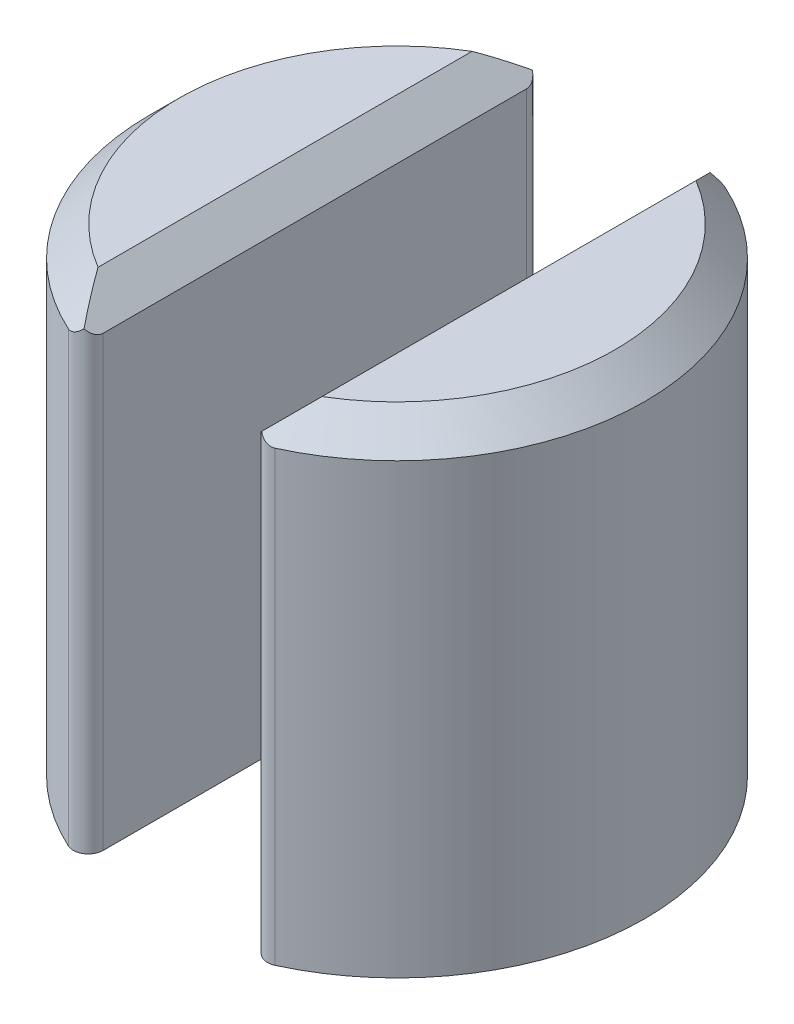
ISO-10303-21;
HEADER;
FILE_DESCRIPTION(('STEP AP214'),'2;1');
FILE_NAME('part.step','',(''),(''),'','','');
FILE_SCHEMA(('AUTOMOTIVE_DESIGN { 1 0 10303 214 1 1 1 1 }'));
ENDSEC;
DATA;
#1=APPLICATION_CONTEXT('core data for automotive mechanical design processes');
#2=APPLICATION_PROTOCOL_DEFINITION('international standard','automotive_design',2000,#1);
#3=PRODUCT_CONTEXT('',#1,'mechanical');
#4=PRODUCT('Part','Part','',(#3));
#5=PRODUCT_RELATED_PRODUCT_CATEGORY('part','',(#4));
#6=PRODUCT_DEFINITION_FORMATION('','',#4);
#7=PRODUCT_DEFINITION_CONTEXT('part definition',#1,'design');
#8=PRODUCT_DEFINITION('design','',#6,#7);
#9=PRODUCT_DEFINITION_SHAPE('','',#8);
#10=(LENGTH_UNIT() NAMED_UNIT(*) SI_UNIT(.MILLI.,.METRE.));
#11=(NAMED_UNIT(*) PLANE_ANGLE_UNIT() SI_UNIT($,.RADIAN.));
#12=(NAMED_UNIT(*) SI_UNIT($,.STERADIAN.) SOLID_ANGLE_UNIT());
#13=UNCERTAINTY_MEASURE_WITH_UNIT(LENGTH_MEASURE(1.E-05),#10,'distance_accuracy_value','');
#14=(GEOMETRIC_REPRESENTATION_CONTEXT(3) GLOBAL_UNCERTAINTY_ASSIGNED_CONTEXT((#13)) GLOBAL_UNIT_ASSIGNED_CONTEXT((#10,
#11,#12)) REPRESENTATION_CONTEXT('',''));
#15=CARTESIAN_POINT('',(0.,0.,0.));
#16=DIRECTION('',(0.,0.,1.));
#17=DIRECTION('',(1.,0.,0.));
#18=AXIS2_PLACEMENT_3D('',#15,#16,#17);
#19=CARTESIAN_POINT('',(0.,3.75,0.));
#20=DIRECTION('',(0.,1.,0.));
#21=DIRECTION('',(0.,0.,1.));
#22=AXIS2_PLACEMENT_3D('',#19,#20,#21);
#23=PLANE('',#22);
#24=DIRECTION('',(0.,0.,1.));
#25=VECTOR('',#24,1.);
#26=CARTESIAN_POINT('',(-1.375,3.75,0.));
#27=LINE('',#26,#25);
#28=CARTESIAN_POINT('',(-1.375,3.75,-0.374999999999998));
#29=VERTEX_POINT('',#28);
#30=CARTESIAN_POINT('',(-1.375,3.75,0.375));
#31=VERTEX_POINT('',#30);
#32=EDGE_CURVE('E203',#29,#31,#27,.T.);
#33=ORIENTED_EDGE('',*,*,#32,.T.);
#34=DIRECTION('',(1.,0.,0.));
#35=VECTOR('',#34,1.);
#36=CARTESIAN_POINT('',(1.375,3.75,0.375));
#37=LINE('',#36,#35);
#38=CARTESIAN_POINT('',(1.375,3.75,0.375));
#39=VERTEX_POINT('',#38);
#40=EDGE_CURVE('E437',#31,#39,#37,.T.);
#41=ORIENTED_EDGE('',*,*,#40,.T.);
#42=DIRECTION('',(0.,0.,-1.));
#43=VECTOR('',#42,1.);
#44=CARTESIAN_POINT('',(1.375,3.75,0.));
#45=LINE('',#44,#43);
#46=CARTESIAN_POINT('',(1.375,3.75,-0.374999999999998));
#47=VERTEX_POINT('',#46);
#48=EDGE_CURVE('E180',#39,#47,#45,.T.);
#49=ORIENTED_EDGE('',*,*,#48,.T.);
#50=DIRECTION('',(-1.,0.,0.));
#51=VECTOR('',#50,1.);
#52=CARTESIAN_POINT('',(0.,3.75,-0.374999999999998));
#53=LINE('',#52,#51);
#54=EDGE_CURVE('E441',#47,#29,#53,.T.);
#55=ORIENTED_EDGE('',*,*,#54,.T.);
#56=EDGE_LOOP('',(#33,#41,#49,#55));
#57=FACE_BOUND('',#56,.T.);
#58=ADVANCED_FACE('F39',(#57),#23,.T.);
#59=CARTESIAN_POINT('',(0.,3.75,0.));
#60=DIRECTION('',(0.,-1.,0.));
#61=DIRECTION('',(0.,0.,-1.));
#62=AXIS2_PLACEMENT_3D('',#59,#60,#61);
#63=CYLINDRICAL_SURFACE('',#62,4.15);
#64=DIRECTION('',(0.,-1.,0.));
#65=VECTOR('',#64,1.);
#66=CARTESIAN_POINT('',(-1.72916666666667,3.75,3.77259627297819));
#67=LINE('',#66,#65);
#68=CARTESIAN_POINT('',(-1.72916666666667,0.,3.77259627297819));
#69=VERTEX_POINT('',#68);
#70=CARTESIAN_POINT('',(-1.72916666666667,7.5,3.77259627297819));
#71=VERTEX_POINT('',#70);
#72=EDGE_CURVE('E217',#69,#71,#67,.F.);
#73=ORIENTED_EDGE('',*,*,#72,.T.);
#74=CARTESIAN_POINT('',(0.,7.5,0.));
#75=DIRECTION('',(0.,1.,0.));
#76=DIRECTION('',(0.,0.,1.));
#77=AXIS2_PLACEMENT_3D('',#74,#75,#76);
#78=CIRCLE('',#77,4.15);
#79=CARTESIAN_POINT('',(-1.72916666666667,7.5,-3.77259627297819));
#80=VERTEX_POINT('',#79);
#81=EDGE_CURVE('E325',#71,#80,#78,.F.);
#82=ORIENTED_EDGE('',*,*,#81,.T.);
#83=DIRECTION('',(0.,-1.,0.));
#84=VECTOR('',#83,1.);
#85=CARTESIAN_POINT('',(-1.72916666666667,3.75,-3.77259627297819));
#86=LINE('',#85,#84);
#87=CARTESIAN_POINT('',(-1.72916666666667,0.,-3.77259627297819));
#88=VERTEX_POINT('',#87);
#89=EDGE_CURVE('E220',#80,#88,#86,.T.);
#90=ORIENTED_EDGE('',*,*,#89,.T.);
#91=CARTESIAN_POINT('',(0.,0.,0.));
#92=DIRECTION('',(0.,1.,0.));
#93=DIRECTION('',(0.,0.,1.));
#94=AXIS2_PLACEMENT_3D('',#91,#92,#93);
#95=CIRCLE('',#94,4.15);
#96=EDGE_CURVE('E196',#88,#69,#95,.T.);
#97=ORIENTED_EDGE('',*,*,#96,.T.);
#98=EDGE_LOOP('',(#73,#82,#90,#97));
#99=FACE_BOUND('',#98,.T.);
#100=ADVANCED_FACE('F375',(#99),#63,.T.);
#101=CARTESIAN_POINT('',(-1.375,3.75,0.));
#102=DIRECTION('',(1.,0.,0.));
#103=DIRECTION('',(0.,0.,-1.));
#104=AXIS2_PLACEMENT_3D('',#101,#102,#103);
#105=PLANE('',#104);
#106=DIRECTION('',(0.,1.,0.));
#107=VECTOR('',#106,1.);
#108=CARTESIAN_POINT('',(-1.375,8.,-3.54533143725661));
#109=LINE('',#108,#107);
#110=CARTESIAN_POINT('',(-1.375,0.,-3.54533143725661));
#111=VERTEX_POINT('',#110);
#112=CARTESIAN_POINT('',(-1.375,7.5,-3.54533143725661));
#113=VERTEX_POINT('',#112);
#114=EDGE_CURVE('E238',#111,#113,#109,.T.);
#115=ORIENTED_EDGE('',*,*,#114,.T.);
#116=DIRECTION('',(0.,0.,1.));
#117=VECTOR('',#116,1.);
#118=CARTESIAN_POINT('',(-1.375,7.5,0.));
#119=LINE('',#118,#117);
#120=CARTESIAN_POINT('',(-1.375,7.5,3.54533143725661));
#121=VERTEX_POINT('',#120);
#122=EDGE_CURVE('E363',#113,#121,#119,.T.);
#123=ORIENTED_EDGE('',*,*,#122,.T.);
#124=DIRECTION('',(0.,1.,0.));
#125=VECTOR('',#124,1.);
#126=CARTESIAN_POINT('',(-1.375,0.,3.54533143725661));
#127=LINE('',#126,#125);
#128=CARTESIAN_POINT('',(-1.375,0.,3.54533143725661));
#129=VERTEX_POINT('',#128);
#130=EDGE_CURVE('E194',#121,#129,#127,.F.);
#131=ORIENTED_EDGE('',*,*,#130,.T.);
#132=DIRECTION('',(0.,0.,1.));
#133=VECTOR('',#132,1.);
#134=CARTESIAN_POINT('',(-1.375,0.,0.));
#135=LINE('',#134,#133);
#136=CARTESIAN_POINT('',(-1.375,0.,0.875));
#137=VERTEX_POINT('',#136);
#138=EDGE_CURVE('E187',#137,#129,#135,.T.);
#139=ORIENTED_EDGE('',*,*,#138,.F.);
#140=DIRECTION('',(0.,-1.,0.));
#141=VECTOR('',#140,1.);
#142=CARTESIAN_POINT('',(-1.375,3.75,0.875));
#143=LINE('',#142,#141);
#144=CARTESIAN_POINT('',(-1.375,3.25,0.875));
#145=VERTEX_POINT('',#144);
#146=EDGE_CURVE('E170',#145,#137,#143,.T.);
#147=ORIENTED_EDGE('',*,*,#146,.F.);
#148=DIRECTION('',(0.,0.707106781186549,-0.707106781186546));
#149=VECTOR('',#148,1.);
#150=CARTESIAN_POINT('',(-1.375,3.75,0.375));
#151=LINE('',#150,#149);
#152=EDGE_CURVE('E435',#145,#31,#151,.T.);
#153=ORIENTED_EDGE('',*,*,#152,.T.);
#154=ORIENTED_EDGE('',*,*,#32,.F.);
#155=DIRECTION('',(0.,0.707106781186546,0.707106781186549));
#156=VECTOR('',#155,1.);
#157=CARTESIAN_POINT('',(-1.375,3.25,-0.875));
#158=LINE('',#157,#156);
#159=CARTESIAN_POINT('',(-1.375,3.25,-0.875));
#160=VERTEX_POINT('',#159);
#161=EDGE_CURVE('E11',#29,#160,#158,.F.);
#162=ORIENTED_EDGE('',*,*,#161,.T.);
#163=DIRECTION('',(0.,-1.,0.));
#164=VECTOR('',#163,1.);
#165=CARTESIAN_POINT('',(-1.375,3.75,-0.875));
#166=LINE('',#165,#164);
#167=CARTESIAN_POINT('',(-1.375,0.,-0.875));
#168=VERTEX_POINT('',#167);
#169=EDGE_CURVE('E431',#160,#168,#166,.T.);
#170=ORIENTED_EDGE('',*,*,#169,.T.);
#171=EDGE_CURVE('E198',#111,#168,#135,.T.);
#172=ORIENTED_EDGE('',*,*,#171,.F.);
#173=EDGE_LOOP('',(#115,#123,#131,#139,#147,#153,#154,#162,#170,#172));
#174=FACE_BOUND('',#173,.T.);
#175=ADVANCED_FACE('F192',(#174),#105,.T.);
#176=CARTESIAN_POINT('',(0.,3.75,0.875));
#177=DIRECTION('',(0.,0.,-1.));
#178=DIRECTION('',(-1.,0.,0.));
#179=AXIS2_PLACEMENT_3D('',#176,#177,#178);
#180=PLANE('',#179);
#181=DIRECTION('',(0.,-1.,0.));
#182=VECTOR('',#181,1.);
#183=CARTESIAN_POINT('',(1.375,3.75,0.875));
#184=LINE('',#183,#182);
#185=CARTESIAN_POINT('',(1.375,3.25,0.875));
#186=VERTEX_POINT('',#185);
#187=CARTESIAN_POINT('',(1.375,0.,0.875));
#188=VERTEX_POINT('',#187);
#189=EDGE_CURVE('E181',#186,#188,#184,.T.);
#190=ORIENTED_EDGE('',*,*,#189,.F.);
#191=DIRECTION('',(-1.,0.,0.));
#192=VECTOR('',#191,1.);
#193=CARTESIAN_POINT('',(-1.375,3.25,0.875));
#194=LINE('',#193,#192);
#195=EDGE_CURVE('E176',#186,#145,#194,.T.);
#196=ORIENTED_EDGE('',*,*,#195,.T.);
#197=ORIENTED_EDGE('',*,*,#146,.T.);
#198=DIRECTION('',(1.,0.,0.));
#199=VECTOR('',#198,1.);
#200=CARTESIAN_POINT('',(0.,0.,0.875));
#201=LINE('',#200,#199);
#202=EDGE_CURVE('E173',#137,#188,#201,.T.);
#203=ORIENTED_EDGE('',*,*,#202,.T.);
#204=EDGE_LOOP('',(#190,#196,#197,#203));
#205=FACE_BOUND('',#204,.T.);
#206=ADVANCED_FACE('F172',(#205),#180,.F.);
#207=CARTESIAN_POINT('',(0.,3.75,0.));
#208=DIRECTION('',(0.,-1.,0.));
#209=DIRECTION('',(0.,0.,-1.));
#210=AXIS2_PLACEMENT_3D('',#207,#208,#209);
#211=CYLINDRICAL_SURFACE('',#210,4.15);
#212=DIRECTION('',(0.,-1.,0.));
#213=VECTOR('',#212,1.);
#214=CARTESIAN_POINT('',(1.72916666666667,3.75,-3.77259627297819));
#215=LINE('',#214,#213);
#216=CARTESIAN_POINT('',(1.72916666666667,0.,-3.77259627297819));
#217=VERTEX_POINT('',#216);
#218=CARTESIAN_POINT('',(1.72916666666667,7.5,-3.77259627297819));
#219=VERTEX_POINT('',#218);
#220=EDGE_CURVE('E247',#217,#219,#215,.F.);
#221=ORIENTED_EDGE('',*,*,#220,.T.);
#222=CARTESIAN_POINT('',(0.,7.5,0.));
#223=DIRECTION('',(0.,1.,0.));
#224=DIRECTION('',(0.,0.,1.));
#225=AXIS2_PLACEMENT_3D('',#222,#223,#224);
#226=CIRCLE('',#225,4.15);
#227=CARTESIAN_POINT('',(1.72916666666667,7.5,3.77259627297819));
#228=VERTEX_POINT('',#227);
#229=EDGE_CURVE('E265',#219,#228,#226,.F.);
#230=ORIENTED_EDGE('',*,*,#229,.T.);
#231=DIRECTION('',(0.,-1.,0.));
#232=VECTOR('',#231,1.);
#233=CARTESIAN_POINT('',(1.72916666666667,3.75,3.77259627297819));
#234=LINE('',#233,#232);
#235=CARTESIAN_POINT('',(1.72916666666667,0.,3.77259627297819));
#236=VERTEX_POINT('',#235);
#237=EDGE_CURVE('E245',#228,#236,#234,.T.);
#238=ORIENTED_EDGE('',*,*,#237,.T.);
#239=CARTESIAN_POINT('',(0.,0.,0.));
#240=DIRECTION('',(0.,1.,0.));
#241=DIRECTION('',(0.,0.,1.));
#242=AXIS2_PLACEMENT_3D('',#239,#240,#241);
#243=CIRCLE('',#242,4.15);
#244=EDGE_CURVE('E421',#236,#217,#243,.T.);
#245=ORIENTED_EDGE('',*,*,#244,.T.);
#246=EDGE_LOOP('',(#221,#230,#238,#245));
#247=FACE_BOUND('',#246,.T.);
#248=ADVANCED_FACE('F382',(#247),#211,.T.);
#249=CARTESIAN_POINT('',(1.375,3.75,0.));
#250=DIRECTION('',(1.,0.,0.));
#251=DIRECTION('',(0.,0.,-1.));
#252=AXIS2_PLACEMENT_3D('',#249,#250,#251);
#253=PLANE('',#252);
#254=DIRECTION('',(0.,-1.,0.));
#255=VECTOR('',#254,1.);
#256=CARTESIAN_POINT('',(1.375,3.75,3.54533143725661));
#257=LINE('',#256,#255);
#258=CARTESIAN_POINT('',(1.375,0.,3.54533143725661));
#259=VERTEX_POINT('',#258);
#260=CARTESIAN_POINT('',(1.375,7.5,3.54533143725661));
#261=VERTEX_POINT('',#260);
#262=EDGE_CURVE('E240',#259,#261,#257,.F.);
#263=ORIENTED_EDGE('',*,*,#262,.T.);
#264=DIRECTION('',(0.,0.,-1.));
#265=VECTOR('',#264,1.);
#266=CARTESIAN_POINT('',(1.375,7.5,-3.54533143725661));
#267=LINE('',#266,#265);
#268=CARTESIAN_POINT('',(1.375,7.5,-3.54533143725661));
#269=VERTEX_POINT('',#268);
#270=EDGE_CURVE('E452',#261,#269,#267,.T.);
#271=ORIENTED_EDGE('',*,*,#270,.T.);
#272=DIRECTION('',(0.,-1.,0.));
#273=VECTOR('',#272,1.);
#274=CARTESIAN_POINT('',(1.375,3.75,-3.54533143725661));
#275=LINE('',#274,#273);
#276=CARTESIAN_POINT('',(1.375,0.,-3.54533143725661));
#277=VERTEX_POINT('',#276);
#278=EDGE_CURVE('E243',#269,#277,#275,.T.);
#279=ORIENTED_EDGE('',*,*,#278,.T.);
#280=DIRECTION('',(0.,0.,1.));
#281=VECTOR('',#280,1.);
#282=CARTESIAN_POINT('',(1.375,0.,0.));
#283=LINE('',#282,#281);
#284=CARTESIAN_POINT('',(1.375,0.,-0.875));
#285=VERTEX_POINT('',#284);
#286=EDGE_CURVE('E424',#277,#285,#283,.T.);
#287=ORIENTED_EDGE('',*,*,#286,.T.);
#288=DIRECTION('',(0.,-1.,0.));
#289=VECTOR('',#288,1.);
#290=CARTESIAN_POINT('',(1.375,3.75,-0.875));
#291=LINE('',#290,#289);
#292=CARTESIAN_POINT('',(1.375,3.25,-0.875));
#293=VERTEX_POINT('',#292);
#294=EDGE_CURVE('E433',#293,#285,#291,.T.);
#295=ORIENTED_EDGE('',*,*,#294,.F.);
#296=DIRECTION('',(0.,-0.707106781186546,-0.707106781186549));
#297=VECTOR('',#296,1.);
#298=CARTESIAN_POINT('',(1.375,3.9375,-0.187499999999998));
#299=LINE('',#298,#297);
#300=EDGE_CURVE('E55',#293,#47,#299,.F.);
#301=ORIENTED_EDGE('',*,*,#300,.T.);
#302=ORIENTED_EDGE('',*,*,#48,.F.);
#303=DIRECTION('',(0.,-0.707106781186549,0.707106781186546));
#304=VECTOR('',#303,1.);
#305=CARTESIAN_POINT('',(1.375,3.9375,0.1875));
#306=LINE('',#305,#304);
#307=EDGE_CURVE('E63',#39,#186,#306,.T.);
#308=ORIENTED_EDGE('',*,*,#307,.T.);
#309=ORIENTED_EDGE('',*,*,#189,.T.);
#310=EDGE_CURVE('E189',#188,#259,#283,.T.);
#311=ORIENTED_EDGE('',*,*,#310,.T.);
#312=EDGE_LOOP('',(#263,#271,#279,#287,#295,#301,#302,#308,#309,#311));
#313=FACE_BOUND('',#312,.T.);
#314=ADVANCED_FACE('F385',(#313),#253,.F.);
#315=CARTESIAN_POINT('',(0.,3.75,-0.875));
#316=DIRECTION('',(0.,0.,-1.));
#317=DIRECTION('',(-1.,0.,0.));
#318=AXIS2_PLACEMENT_3D('',#315,#316,#317);
#319=PLANE('',#318);
#320=ORIENTED_EDGE('',*,*,#169,.F.);
#321=DIRECTION('',(1.,0.,0.));
#322=VECTOR('',#321,1.);
#323=CARTESIAN_POINT('',(0.,3.25,-0.875));
#324=LINE('',#323,#322);
#325=EDGE_CURVE('E436',#160,#293,#324,.T.);
#326=ORIENTED_EDGE('',*,*,#325,.T.);
#327=ORIENTED_EDGE('',*,*,#294,.T.);
#328=DIRECTION('',(1.,0.,0.));
#329=VECTOR('',#328,1.);
#330=CARTESIAN_POINT('',(0.,0.,-0.875));
#331=LINE('',#330,#329);
#332=EDGE_CURVE('E427',#168,#285,#331,.T.);
#333=ORIENTED_EDGE('',*,*,#332,.F.);
#334=EDGE_LOOP('',(#320,#326,#327,#333));
#335=FACE_BOUND('',#334,.T.);
#336=ADVANCED_FACE('F389',(#335),#319,.T.);
#337=CARTESIAN_POINT('',(0.,0.,0.));
#338=DIRECTION('',(0.,1.,0.));
#339=DIRECTION('',(0.,0.,1.));
#340=AXIS2_PLACEMENT_3D('',#337,#338,#339);
#341=PLANE('',#340);
#342=ORIENTED_EDGE('',*,*,#96,.F.);
#343=CARTESIAN_POINT('',(-1.625,0.,-3.54533143725661));
#344=DIRECTION('',(0.,1.,0.));
#345=DIRECTION('',(0.,0.,1.));
#346=AXIS2_PLACEMENT_3D('',#343,#344,#345);
#347=CIRCLE('',#346,0.25);
#348=EDGE_CURVE('E235',#88,#111,#347,.F.);
#349=ORIENTED_EDGE('',*,*,#348,.T.);
#350=ORIENTED_EDGE('',*,*,#171,.T.);
#351=ORIENTED_EDGE('',*,*,#332,.T.);
#352=ORIENTED_EDGE('',*,*,#286,.F.);
#353=CARTESIAN_POINT('',(1.625,0.,-3.54533143725661));
#354=DIRECTION('',(0.,1.,0.));
#355=DIRECTION('',(0.,0.,1.));
#356=AXIS2_PLACEMENT_3D('',#353,#354,#355);
#357=CIRCLE('',#356,0.25);
#358=EDGE_CURVE('E233',#277,#217,#357,.F.);
#359=ORIENTED_EDGE('',*,*,#358,.T.);
#360=ORIENTED_EDGE('',*,*,#244,.F.);
#361=CARTESIAN_POINT('',(1.625,0.,3.54533143725661));
#362=DIRECTION('',(0.,1.,0.));
#363=DIRECTION('',(0.,0.,1.));
#364=AXIS2_PLACEMENT_3D('',#361,#362,#363);
#365=CIRCLE('',#364,0.25);
#366=EDGE_CURVE('E226',#236,#259,#365,.F.);
#367=ORIENTED_EDGE('',*,*,#366,.T.);
#368=ORIENTED_EDGE('',*,*,#310,.F.);
#369=ORIENTED_EDGE('',*,*,#202,.F.);
#370=ORIENTED_EDGE('',*,*,#138,.T.);
#371=CARTESIAN_POINT('',(-1.625,0.,3.54533143725661));
#372=DIRECTION('',(0.,1.,0.));
#373=DIRECTION('',(0.,0.,1.));
#374=AXIS2_PLACEMENT_3D('',#371,#372,#373);
#375=CIRCLE('',#374,0.25);
#376=EDGE_CURVE('E231',#129,#69,#375,.F.);
#377=ORIENTED_EDGE('',*,*,#376,.T.);
#378=EDGE_LOOP('',(#342,#349,#350,#351,#352,#359,#360,#367,#368,#369,#370,#377));
#379=FACE_BOUND('',#378,.T.);
#380=ADVANCED_FACE('F186',(#379),#341,.F.);
#381=CARTESIAN_POINT('',(0.,8.,0.));
#382=DIRECTION('',(0.,1.,0.));
#383=DIRECTION('',(0.,0.,1.));
#384=AXIS2_PLACEMENT_3D('',#381,#382,#383);
#385=PLANE('',#384);
#386=DIRECTION('',(0.,0.,1.));
#387=VECTOR('',#386,1.);
#388=CARTESIAN_POINT('',(1.875,8.,3.54533143725661));
#389=LINE('',#388,#387);
#390=CARTESIAN_POINT('',(1.875,8.,-3.13159304508105));
#391=VERTEX_POINT('',#390);
#392=CARTESIAN_POINT('',(1.875,8.,3.13159304508105));
#393=VERTEX_POINT('',#392);
#394=EDGE_CURVE('E250',#391,#393,#389,.T.);
#395=ORIENTED_EDGE('',*,*,#394,.T.);
#396=CARTESIAN_POINT('',(0.,8.,0.));
#397=DIRECTION('',(0.,1.,0.));
#398=DIRECTION('',(0.,0.,1.));
#399=AXIS2_PLACEMENT_3D('',#396,#397,#398);
#400=CIRCLE('',#399,3.65);
#401=EDGE_CURVE('E252',#393,#391,#400,.T.);
#402=ORIENTED_EDGE('',*,*,#401,.T.);
#403=EDGE_LOOP('',(#395,#402));
#404=FACE_BOUND('',#403,.T.);
#405=ADVANCED_FACE('F395',(#404),#385,.T.);
#406=CARTESIAN_POINT('',(0.,8.,0.));
#407=DIRECTION('',(0.,1.,0.));
#408=DIRECTION('',(0.,0.,1.));
#409=AXIS2_PLACEMENT_3D('',#406,#407,#408);
#410=PLANE('',#409);
#411=DIRECTION('',(0.,0.,-1.));
#412=VECTOR('',#411,1.);
#413=CARTESIAN_POINT('',(-1.875,8.,0.));
#414=LINE('',#413,#412);
#415=CARTESIAN_POINT('',(-1.875,8.,3.13159304508105));
#416=VERTEX_POINT('',#415);
#417=CARTESIAN_POINT('',(-1.875,8.,-3.13159304508105));
#418=VERTEX_POINT('',#417);
#419=EDGE_CURVE('E343',#416,#418,#414,.T.);
#420=ORIENTED_EDGE('',*,*,#419,.T.);
#421=CARTESIAN_POINT('',(0.,8.,0.));
#422=DIRECTION('',(0.,1.,0.));
#423=DIRECTION('',(0.,0.,1.));
#424=AXIS2_PLACEMENT_3D('',#421,#422,#423);
#425=CIRCLE('',#424,3.65);
#426=EDGE_CURVE('E345',#418,#416,#425,.T.);
#427=ORIENTED_EDGE('',*,*,#426,.T.);
#428=EDGE_LOOP('',(#420,#427));
#429=FACE_BOUND('',#428,.T.);
#430=ADVANCED_FACE('F374',(#429),#410,.T.);
#431=CARTESIAN_POINT('',(-1.625,3.75,-3.54533143725661));
#432=DIRECTION('',(0.,-1.,0.));
#433=DIRECTION('',(0.,0.,-1.));
#434=AXIS2_PLACEMENT_3D('',#431,#432,#433);
#435=CYLINDRICAL_SURFACE('',#434,0.25);
#436=ORIENTED_EDGE('',*,*,#89,.F.);
#437=CARTESIAN_POINT('',(-1.72916666666667,7.5,-3.77259627297819));
#438=CARTESIAN_POINT('',(-1.71881783309782,7.4999830705019,-3.77736025602022));
#439=CARTESIAN_POINT('',(-1.70815266342399,7.50073059903568,-3.78137280225928));
#440=CARTESIAN_POINT('',(-1.68663657627427,7.50360854439156,-3.78786726120898));
#441=CARTESIAN_POINT('',(-1.67578781494084,7.5057278988891,-3.79036111106012));
#442=CARTESIAN_POINT('',(-1.65420058249301,7.51120110246739,-3.79386214748044));
#443=CARTESIAN_POINT('',(-1.64346191196882,7.51455203584125,-3.79487281742112));
#444=CARTESIAN_POINT('',(-1.62231123515911,7.52229727816951,-3.79554120373631));
#445=CARTESIAN_POINT('',(-1.61189995397845,7.52669374058384,-3.7951961045793));
#446=CARTESIAN_POINT('',(-1.58780799561595,7.53813692361637,-3.79294559656265));
#447=CARTESIAN_POINT('',(-1.57435631488678,7.5455605193213,-3.79050621416916));
#448=CARTESIAN_POINT('',(-1.54867832058486,7.56157837026592,-3.78376786600594));
#449=CARTESIAN_POINT('',(-1.53645406815352,7.57017453928716,-3.77946583468125));
#450=CARTESIAN_POINT('',(-1.50916397285393,7.5914551558825,-3.76753969898065));
#451=CARTESIAN_POINT('',(-1.49465762061566,7.6044979543463,-3.75927725983504));
#452=CARTESIAN_POINT('',(-1.46812132823299,7.63156433632232,-3.74065822512836));
#453=CARTESIAN_POINT('',(-1.45609577976962,7.64558960127232,-3.73029797903761));
#454=CARTESIAN_POINT('',(-1.43152370104035,7.67817145579889,-3.70489164108378));
#455=CARTESIAN_POINT('',(-1.41974445832603,7.69691291087243,-3.68934062250799));
#456=CARTESIAN_POINT('',(-1.40016877881309,7.73475279580196,-3.65632299017517));
#457=CARTESIAN_POINT('',(-1.39237137098618,7.75385113744722,-3.63885684471291));
#458=CARTESIAN_POINT('',(-1.38282275566284,7.78547293605356,-3.60865227857087));
#459=CARTESIAN_POINT('',(-1.37991878625748,7.7980372148411,-3.59631086265983));
#460=CARTESIAN_POINT('',(-1.37601501273369,7.8229180191182,-3.57115434197564));
#461=CARTESIAN_POINT('',(-1.37501034849712,7.83523509695046,-3.55834053200167));
#462=CARTESIAN_POINT('',(-1.375,7.84736933163369,-3.54533143725661));
#463=B_SPLINE_CURVE_WITH_KNOTS('',3,(#437,#438,#439,#440,#441,#442,#443,#444,#445,#446,#447,
#448,#449,#450,#451,#452,#453,#454,#455,#456,#457,#458,#459,#460,#461,#462),.UNSPECIFIED.,.F.,
.F.,(4,2,2,2,2,2,2,2,2,2,2,2,4),(0.,0.0340853845239794,0.0678992741892139,0.101633621316076,
0.135438061701339,0.181851333017763,0.228341283584399,0.29155356731773,0.354876811066045,
0.435625638956218,0.516354765656781,0.569802312684825,0.623112907072104),.UNSPECIFIED.);
#464=CARTESIAN_POINT('',(-1.48720713030475,7.61220713030475,-3.75392943595541));
#465=VERTEX_POINT('',#464);
#466=EDGE_CURVE('E357',#80,#465,#463,.T.);
#467=ORIENTED_EDGE('',*,*,#466,.T.);
#468=CARTESIAN_POINT('',(-1.625,7.75,-3.54533143725661));
#469=DIRECTION('',(-0.707106781186546,-0.707106781186549,0.));
#470=DIRECTION('',(0.707106781186549,-0.707106781186546,0.));
#471=AXIS2_PLACEMENT_3D('',#468,#469,#470);
#472=ELLIPSE('',#471,0.353553390593273,0.25);
#473=EDGE_CURVE('E359',#465,#113,#472,.T.);
#474=ORIENTED_EDGE('',*,*,#473,.T.);
#475=ORIENTED_EDGE('',*,*,#114,.F.);
#476=ORIENTED_EDGE('',*,*,#348,.F.);
#477=EDGE_LOOP('',(#436,#467,#474,#475,#476));
#478=FACE_BOUND('',#477,.T.);
#479=ADVANCED_FACE('F370',(#478),#435,.T.);
#480=CARTESIAN_POINT('',(1.625,3.75,-3.54533143725661));
#481=DIRECTION('',(0.,-1.,0.));
#482=DIRECTION('',(0.,0.,-1.));
#483=AXIS2_PLACEMENT_3D('',#480,#481,#482);
#484=CYLINDRICAL_SURFACE('',#483,0.25);
#485=CARTESIAN_POINT('',(1.625,7.75,-3.54533143725661));
#486=DIRECTION('',(-0.707106781186546,0.707106781186549,0.));
#487=DIRECTION('',(-0.707106781186549,-0.707106781186546,0.));
#488=AXIS2_PLACEMENT_3D('',#485,#486,#487);
#489=ELLIPSE('',#488,0.353553390593273,0.25);
#490=CARTESIAN_POINT('',(1.48720713030475,7.61220713030475,-3.75392943595541));
#491=VERTEX_POINT('',#490);
#492=EDGE_CURVE('E255',#269,#491,#489,.F.);
#493=ORIENTED_EDGE('',*,*,#492,.T.);
#494=CARTESIAN_POINT('',(1.375,7.84736933163369,-3.54533143725661));
#495=CARTESIAN_POINT('',(1.37504640206155,7.82888948212373,-3.56512505463033));
#496=CARTESIAN_POINT('',(1.37735011945853,7.80999457089825,-3.58448561197184));
#497=CARTESIAN_POINT('',(1.38625187402104,7.77177601563695,-3.62200934261495));
#498=CARTESIAN_POINT('',(1.39287744290199,7.75245039542666,-3.64016401136365));
#499=CARTESIAN_POINT('',(1.41025167975014,7.71389898775465,-3.67478978500175));
#500=CARTESIAN_POINT('',(1.4210267099319,7.69467465200369,-3.69124925478717));
#501=CARTESIAN_POINT('',(1.44668214452567,7.65704093721944,-3.72167668481314));
#502=CARTESIAN_POINT('',(1.46155101530813,7.63862943482117,-3.73565146580143));
#503=CARTESIAN_POINT('',(1.48951366217391,7.60955551077115,-3.755874429007));
#504=CARTESIAN_POINT('',(1.50141473208574,7.59843189390565,-3.76311677572567));
#505=CARTESIAN_POINT('',(1.52697113728968,7.57718255021618,-3.77575049234628));
#506=CARTESIAN_POINT('',(1.54062385603496,7.56705537402625,-3.78114457986547));
#507=CARTESIAN_POINT('',(1.56626093348939,7.55040674441022,-3.78861106800735));
#508=CARTESIAN_POINT('',(1.57791338601129,7.54359021027498,-3.79116089044653));
#509=CARTESIAN_POINT('',(1.60206067644903,7.53110676122939,-3.79457406892785));
#510=CARTESIAN_POINT('',(1.61455459059889,7.52543861216,-3.79543924415138));
#511=CARTESIAN_POINT('',(1.63779516720285,7.51647847579421,-3.79522337318913));
#512=CARTESIAN_POINT('',(1.6484501562975,7.51294226131675,-3.79446543083123));
#513=CARTESIAN_POINT('',(1.66988198394171,7.5070641932557,-3.79150615645302));
#514=CARTESIAN_POINT('',(1.68065853978277,7.50471999104154,-3.78930768244757));
#515=CARTESIAN_POINT('',(1.69775751379645,7.50204177260611,-3.78460307563035));
#516=CARTESIAN_POINT('',(1.70414690749849,7.50127907832609,-3.78256699999986));
#517=CARTESIAN_POINT('',(1.71678361474439,7.50025705934362,-3.77797113146794));
#518=CARTESIAN_POINT('',(1.72303076276858,7.49999829412177,-3.77541075995392));
#519=CARTESIAN_POINT('',(1.72916666666675,7.49999999999943,-3.77259627297881));
#520=B_SPLINE_CURVE_WITH_KNOTS('',3,(#494,#495,#496,#497,#498,#499,#500,#501,#502,#503,#504,
#505,#506,#507,#508,#509,#510,#511,#512,#513,#514,#515,#516,#517,#518,#519),.UNSPECIFIED.,.F.,
.F.,(4,2,2,2,2,2,2,2,2,2,2,2,4),(0.,0.0810980354722197,0.162717806786109,0.244864912375921,
0.326782911127607,0.380100382165887,0.433339117174111,0.474409455712125,0.515435419427052,
0.54905623464251,0.582610547312416,0.602820652582551,0.623053183092529),.UNSPECIFIED.);
#521=EDGE_CURVE('E257',#491,#219,#520,.T.);
#522=ORIENTED_EDGE('',*,*,#521,.T.);
#523=ORIENTED_EDGE('',*,*,#220,.F.);
#524=ORIENTED_EDGE('',*,*,#358,.F.);
#525=ORIENTED_EDGE('',*,*,#278,.F.);
#526=EDGE_LOOP('',(#493,#522,#523,#524,#525));
#527=FACE_BOUND('',#526,.T.);
#528=ADVANCED_FACE('F267',(#527),#484,.T.);
#529=CARTESIAN_POINT('',(-1.625,3.75,3.54533143725661));
#530=DIRECTION('',(0.,-1.,0.));
#531=DIRECTION('',(0.,0.,-1.));
#532=AXIS2_PLACEMENT_3D('',#529,#530,#531);
#533=CYLINDRICAL_SURFACE('',#532,0.25);
#534=CARTESIAN_POINT('',(-1.625,7.75,3.54533143725661));
#535=DIRECTION('',(-0.707106781186546,-0.707106781186549,0.));
#536=DIRECTION('',(0.707106781186549,-0.707106781186546,0.));
#537=AXIS2_PLACEMENT_3D('',#534,#535,#536);
#538=ELLIPSE('',#537,0.353553390593273,0.25);
#539=CARTESIAN_POINT('',(-1.48720713030475,7.61220713030475,3.75392943595541));
#540=VERTEX_POINT('',#539);
#541=EDGE_CURVE('E326',#121,#540,#538,.T.);
#542=ORIENTED_EDGE('',*,*,#541,.T.);
#543=CARTESIAN_POINT('',(-1.375,7.84736933163369,3.54533143725661));
#544=CARTESIAN_POINT('',(-1.37504640206155,7.82888948212373,3.56512505463033));
#545=CARTESIAN_POINT('',(-1.37735011945853,7.80999457089825,3.58448561197184));
#546=CARTESIAN_POINT('',(-1.38625187402104,7.77177601563695,3.62200934261495));
#547=CARTESIAN_POINT('',(-1.39287744290199,7.75245039542666,3.64016401136365));
#548=CARTESIAN_POINT('',(-1.41025167975014,7.71389898775465,3.67478978500175));
#549=CARTESIAN_POINT('',(-1.4210267099319,7.69467465200369,3.69124925478717));
#550=CARTESIAN_POINT('',(-1.44668214452567,7.65704093721944,3.72167668481314));
#551=CARTESIAN_POINT('',(-1.46155101530813,7.63862943482117,3.73565146580143));
#552=CARTESIAN_POINT('',(-1.48951366217391,7.60955551077115,3.755874429007));
#553=CARTESIAN_POINT('',(-1.50141473208574,7.59843189390565,3.76311677572567));
#554=CARTESIAN_POINT('',(-1.52697113728968,7.57718255021618,3.77575049234628));
#555=CARTESIAN_POINT('',(-1.54062385603496,7.56705537402625,3.78114457986547));
#556=CARTESIAN_POINT('',(-1.56626093348939,7.55040674441022,3.78861106800735));
#557=CARTESIAN_POINT('',(-1.57791338601129,7.54359021027498,3.79116089044653));
#558=CARTESIAN_POINT('',(-1.60206067644903,7.53110676122939,3.79457406892785));
#559=CARTESIAN_POINT('',(-1.61455459059889,7.52543861216,3.79543924415138));
#560=CARTESIAN_POINT('',(-1.63779516720285,7.51647847579421,3.79522337318913));
#561=CARTESIAN_POINT('',(-1.6484501562975,7.51294226131675,3.79446543083123));
#562=CARTESIAN_POINT('',(-1.66988198394171,7.5070641932557,3.79150615645302));
#563=CARTESIAN_POINT('',(-1.68065853978277,7.50471999104154,3.78930768244757));
#564=CARTESIAN_POINT('',(-1.69775751379645,7.50204177260611,3.78460307563035));
#565=CARTESIAN_POINT('',(-1.70414690749849,7.50127907832609,3.78256699999986));
#566=CARTESIAN_POINT('',(-1.71678361474439,7.50025705934362,3.77797113146794));
#567=CARTESIAN_POINT('',(-1.72303076276858,7.49999829412177,3.77541075995392));
#568=CARTESIAN_POINT('',(-1.72916666666675,7.49999999999943,3.77259627297881));
#569=B_SPLINE_CURVE_WITH_KNOTS('',3,(#543,#544,#545,#546,#547,#548,#549,#550,#551,#552,#553,
#554,#555,#556,#557,#558,#559,#560,#561,#562,#563,#564,#565,#566,#567,#568),.UNSPECIFIED.,.F.,
.F.,(4,2,2,2,2,2,2,2,2,2,2,2,4),(0.,0.0810980354722197,0.162717806786109,0.244864912375921,
0.326782911127607,0.380100382165887,0.433339117174111,0.474409455712125,0.515435419427052,
0.54905623464251,0.582610547312416,0.602820652582551,0.623053183092529),.UNSPECIFIED.);
#570=EDGE_CURVE('E318',#540,#71,#569,.T.);
#571=ORIENTED_EDGE('',*,*,#570,.T.);
#572=ORIENTED_EDGE('',*,*,#72,.F.);
#573=ORIENTED_EDGE('',*,*,#376,.F.);
#574=ORIENTED_EDGE('',*,*,#130,.F.);
#575=EDGE_LOOP('',(#542,#571,#572,#573,#574));
#576=FACE_BOUND('',#575,.T.);
#577=ADVANCED_FACE('F329',(#576),#533,.T.);
#578=CARTESIAN_POINT('',(1.625,3.75,3.54533143725661));
#579=DIRECTION('',(0.,-1.,0.));
#580=DIRECTION('',(0.,0.,-1.));
#581=AXIS2_PLACEMENT_3D('',#578,#579,#580);
#582=CYLINDRICAL_SURFACE('',#581,0.25);
#583=ORIENTED_EDGE('',*,*,#237,.F.);
#584=CARTESIAN_POINT('',(1.72916666666667,7.5,3.77259627297819));
#585=CARTESIAN_POINT('',(1.71881783309782,7.4999830705019,3.77736025602022));
#586=CARTESIAN_POINT('',(1.70815266342399,7.50073059903568,3.78137280225928));
#587=CARTESIAN_POINT('',(1.68663657627427,7.50360854439156,3.78786726120898));
#588=CARTESIAN_POINT('',(1.67578781494084,7.5057278988891,3.79036111106012));
#589=CARTESIAN_POINT('',(1.65420058249301,7.51120110246739,3.79386214748044));
#590=CARTESIAN_POINT('',(1.64346191196882,7.51455203584125,3.79487281742112));
#591=CARTESIAN_POINT('',(1.62231123515911,7.52229727816951,3.79554120373631));
#592=CARTESIAN_POINT('',(1.61189995397845,7.52669374058384,3.7951961045793));
#593=CARTESIAN_POINT('',(1.58780799561595,7.53813692361637,3.79294559656265));
#594=CARTESIAN_POINT('',(1.57435631488678,7.5455605193213,3.79050621416916));
#595=CARTESIAN_POINT('',(1.54867832058486,7.56157837026592,3.78376786600594));
#596=CARTESIAN_POINT('',(1.53645406815352,7.57017453928716,3.77946583468125));
#597=CARTESIAN_POINT('',(1.50916397285393,7.5914551558825,3.76753969898065));
#598=CARTESIAN_POINT('',(1.49465762061566,7.6044979543463,3.75927725983504));
#599=CARTESIAN_POINT('',(1.46812132823299,7.63156433632232,3.74065822512836));
#600=CARTESIAN_POINT('',(1.45609577976962,7.64558960127232,3.73029797903761));
#601=CARTESIAN_POINT('',(1.43152370104035,7.67817145579889,3.70489164108378));
#602=CARTESIAN_POINT('',(1.41974445832603,7.69691291087243,3.68934062250799));
#603=CARTESIAN_POINT('',(1.40016877881309,7.73475279580196,3.65632299017517));
#604=CARTESIAN_POINT('',(1.39237137098618,7.75385113744722,3.63885684471291));
#605=CARTESIAN_POINT('',(1.38282275566284,7.78547293605356,3.60865227857087));
#606=CARTESIAN_POINT('',(1.37991878625748,7.7980372148411,3.59631086265983));
#607=CARTESIAN_POINT('',(1.37601501273369,7.8229180191182,3.57115434197564));
#608=CARTESIAN_POINT('',(1.37501034849712,7.83523509695046,3.55834053200167));
#609=CARTESIAN_POINT('',(1.375,7.84736933163369,3.54533143725661));
#610=B_SPLINE_CURVE_WITH_KNOTS('',3,(#584,#585,#586,#587,#588,#589,#590,#591,#592,#593,#594,
#595,#596,#597,#598,#599,#600,#601,#602,#603,#604,#605,#606,#607,#608,#609),.UNSPECIFIED.,.F.,
.F.,(4,2,2,2,2,2,2,2,2,2,2,2,4),(0.,0.0340853845239794,0.0678992741892139,0.101633621316076,
0.135438061701339,0.181851333017763,0.228341283584399,0.29155356731773,0.354876811066045,
0.435625638956218,0.516354765656781,0.569802312684825,0.623112907072104),.UNSPECIFIED.);
#611=CARTESIAN_POINT('',(1.48720713030475,7.61220713030475,3.75392943595541));
#612=VERTEX_POINT('',#611);
#613=EDGE_CURVE('E337',#228,#612,#610,.T.);
#614=ORIENTED_EDGE('',*,*,#613,.T.);
#615=CARTESIAN_POINT('',(1.625,7.75,3.54533143725661));
#616=DIRECTION('',(-0.707106781186546,0.707106781186549,0.));
#617=DIRECTION('',(-0.707106781186549,-0.707106781186546,0.));
#618=AXIS2_PLACEMENT_3D('',#615,#616,#617);
#619=ELLIPSE('',#618,0.353553390593273,0.25);
#620=EDGE_CURVE('E344',#612,#261,#619,.F.);
#621=ORIENTED_EDGE('',*,*,#620,.T.);
#622=ORIENTED_EDGE('',*,*,#262,.F.);
#623=ORIENTED_EDGE('',*,*,#366,.F.);
#624=EDGE_LOOP('',(#583,#614,#621,#622,#623));
#625=FACE_BOUND('',#624,.T.);
#626=ADVANCED_FACE('F332',(#625),#582,.T.);
#627=CARTESIAN_POINT('',(1.375,7.5,0.));
#628=DIRECTION('',(-0.707106781186546,0.707106781186549,0.));
#629=DIRECTION('',(0.,0.,1.));
#630=AXIS2_PLACEMENT_3D('',#627,#628,#629);
#631=PLANE('',#630);
#632=ORIENTED_EDGE('',*,*,#270,.F.);
#633=ORIENTED_EDGE('',*,*,#620,.F.);
#634=CARTESIAN_POINT('',(2.52599143774479,8.65099143774479,1.61660743933712));
#635=CARTESIAN_POINT('',(2.48558558969926,8.61058558969926,1.75468853333332));
#636=CARTESIAN_POINT('',(2.44080256250513,8.56580256250512,1.8900629421282));
#637=CARTESIAN_POINT('',(2.34376483547159,8.46876483547158,2.15512685769684));
#638=CARTESIAN_POINT('',(2.2915207353477,8.4165207353477,2.28482409402913));
#639=CARTESIAN_POINT('',(2.1811327330915,8.30613273309149,2.53771249249107));
#640=CARTESIAN_POINT('',(2.12303532146233,8.24803532146233,2.66094467746944));
#641=CARTESIAN_POINT('',(2.00160365252643,8.12660365252643,2.90214607097399));
#642=CARTESIAN_POINT('',(1.93826858694375,8.06326858694375,3.02011446284965));
#643=CARTESIAN_POINT('',(1.83298814484587,7.95798814484587,3.20562172613238));
#644=CARTESIAN_POINT('',(1.79242672865042,7.91742672865042,3.2747472746879));
#645=CARTESIAN_POINT('',(1.70979805138928,7.83479805138928,3.41130779271538));
#646=CARTESIAN_POINT('',(1.66772913964451,7.79272913964451,3.47874076243396));
#647=CARTESIAN_POINT('',(1.51361259918889,7.63861259918889,3.71892169085086));
#648=CARTESIAN_POINT('',(1.39773859461864,7.52273859461864,3.88678809750086));
#649=CARTESIAN_POINT('',(1.15902290819519,7.2840229081952,4.21247549861816));
#650=CARTESIAN_POINT('',(1.03617516681205,7.16117516681205,4.37028749605334));
#651=CARTESIAN_POINT('',(0.785568096809955,6.91056809680996,4.67636792551388));
#652=CARTESIAN_POINT('',(0.65783099616473,6.78283099616473,4.82467286872665));
#653=CARTESIAN_POINT('',(0.463127245731446,6.58812724573145,5.04115588922759));
#654=CARTESIAN_POINT('',(0.39777009270406,6.52277009270406,5.11225960833522));
#655=CARTESIAN_POINT('',(0.266092614073158,6.39109261407316,5.2526395316454));
#656=CARTESIAN_POINT('',(0.199772396481136,6.32477239648114,5.32191593837095));
#657=CARTESIAN_POINT('',(0.133015695766818,6.25801569576682,5.39034336214092));
#658=B_SPLINE_CURVE_WITH_KNOTS('',3,(#634,#635,#636,#637,#638,#639,#640,#641,#642,#643,#644,
#645,#646,#647,#648,#649,#650,#651,#652,#653,#654,#655,#656,#657),.UNSPECIFIED.,.F.,.F.,(4,2,2,
2,2,2,2,2,2,2,2,4),(0.,0.447968035782795,0.895305873849084,1.33933535059329,1.78343347839518,
2.05287488317554,2.32262092198078,3.02580171128727,3.72960314062651,4.43051596467691,
4.78034078770595,5.1301266749596),.UNSPECIFIED.);
#659=EDGE_CURVE('E208',#393,#612,#658,.T.);
#660=ORIENTED_EDGE('',*,*,#659,.F.);
#661=ORIENTED_EDGE('',*,*,#394,.F.);
#662=CARTESIAN_POINT('',(2.52599143774479,8.65099143774479,-1.61660743933712));
#663=CARTESIAN_POINT('',(2.48558558969926,8.61058558969926,-1.75468853333331));
#664=CARTESIAN_POINT('',(2.44080256250513,8.56580256250512,-1.8900629421282));
#665=CARTESIAN_POINT('',(2.34376483547159,8.46876483547159,-2.15512685769684));
#666=CARTESIAN_POINT('',(2.2915207353477,8.4165207353477,-2.28482409402913));
#667=CARTESIAN_POINT('',(2.1811327330915,8.3061327330915,-2.53771249249107));
#668=CARTESIAN_POINT('',(2.12303532146233,8.24803532146233,-2.66094467746944));
#669=CARTESIAN_POINT('',(2.00160365252643,8.12660365252643,-2.90214607097398));
#670=CARTESIAN_POINT('',(1.93826858694375,8.06326858694375,-3.02011446284965));
#671=CARTESIAN_POINT('',(1.83298814484587,7.95798814484587,-3.20562172613238));
#672=CARTESIAN_POINT('',(1.79242672865042,7.91742672865042,-3.2747472746879));
#673=CARTESIAN_POINT('',(1.70979805138928,7.83479805138928,-3.41130779271537));
#674=CARTESIAN_POINT('',(1.66772913964451,7.79272913964451,-3.47874076243396));
#675=CARTESIAN_POINT('',(1.51361259918889,7.63861259918889,-3.71892169085086));
#676=CARTESIAN_POINT('',(1.39773859461864,7.52273859461864,-3.88678809750086));
#677=CARTESIAN_POINT('',(1.15902290819519,7.2840229081952,-4.21247549861816));
#678=CARTESIAN_POINT('',(1.03617516681205,7.16117516681205,-4.37028749605334));
#679=CARTESIAN_POINT('',(0.785568096809954,6.91056809680996,-4.67636792551388));
#680=CARTESIAN_POINT('',(0.657830996164729,6.78283099616473,-4.82467286872665));
#681=CARTESIAN_POINT('',(0.463127245731445,6.58812724573145,-5.04115588922759));
#682=CARTESIAN_POINT('',(0.397770092704058,6.52277009270406,-5.11225960833523));
#683=CARTESIAN_POINT('',(0.266092614073155,6.39109261407316,-5.2526395316454));
#684=CARTESIAN_POINT('',(0.199772396481133,6.32477239648114,-5.32191593837096));
#685=CARTESIAN_POINT('',(0.133015695766815,6.25801569576682,-5.39034336214092));
#686=B_SPLINE_CURVE_WITH_KNOTS('',3,(#662,#663,#664,#665,#666,#667,#668,#669,#670,#671,#672,
#673,#674,#675,#676,#677,#678,#679,#680,#681,#682,#683,#684,#685),.UNSPECIFIED.,.F.,.F.,(4,2,2,
2,2,2,2,2,2,2,2,4),(0.,0.447968035782794,0.895305873849082,1.33933535059328,1.78343347839518,
2.05287488317554,2.32262092198078,3.02580171128727,3.72960314062651,4.43051596467691,
4.78034078770595,5.13012667495961),.UNSPECIFIED.);
#687=EDGE_CURVE('E215',#491,#391,#686,.F.);
#688=ORIENTED_EDGE('',*,*,#687,.F.);
#689=ORIENTED_EDGE('',*,*,#492,.F.);
#690=EDGE_LOOP('',(#632,#633,#660,#661,#688,#689));
#691=FACE_BOUND('',#690,.T.);
#692=ADVANCED_FACE('F280',(#691),#631,.T.);
#693=CARTESIAN_POINT('',(0.,8.,0.));
#694=DIRECTION('',(0.,-1.,0.));
#695=DIRECTION('',(0.,0.,-1.));
#696=AXIS2_PLACEMENT_3D('',#693,#694,#695);
#697=CONICAL_SURFACE('',#696,3.65,0.785398163397448);
#698=ORIENTED_EDGE('',*,*,#613,.F.);
#699=ORIENTED_EDGE('',*,*,#229,.F.);
#700=ORIENTED_EDGE('',*,*,#521,.F.);
#701=ORIENTED_EDGE('',*,*,#687,.T.);
#702=ORIENTED_EDGE('',*,*,#401,.F.);
#703=ORIENTED_EDGE('',*,*,#659,.T.);
#704=EDGE_LOOP('',(#698,#699,#700,#701,#702,#703));
#705=FACE_BOUND('',#704,.T.);
#706=ADVANCED_FACE('F272',(#705),#697,.T.);
#707=CARTESIAN_POINT('',(-1.375,7.5,0.));
#708=DIRECTION('',(-0.707106781186546,-0.707106781186549,0.));
#709=DIRECTION('',(0.,0.,1.));
#710=AXIS2_PLACEMENT_3D('',#707,#708,#709);
#711=PLANE('',#710);
#712=ORIENTED_EDGE('',*,*,#122,.F.);
#713=ORIENTED_EDGE('',*,*,#473,.F.);
#714=CARTESIAN_POINT('',(-2.52599143774479,8.65099143774479,-1.61660743933712));
#715=CARTESIAN_POINT('',(-2.48558558969926,8.61058558969926,-1.75468853333332));
#716=CARTESIAN_POINT('',(-2.44080256250513,8.56580256250512,-1.8900629421282));
#717=CARTESIAN_POINT('',(-2.34376483547159,8.46876483547158,-2.15512685769684));
#718=CARTESIAN_POINT('',(-2.2915207353477,8.4165207353477,-2.28482409402913));
#719=CARTESIAN_POINT('',(-2.1811327330915,8.30613273309149,-2.53771249249107));
#720=CARTESIAN_POINT('',(-2.12303532146233,8.24803532146233,-2.66094467746944));
#721=CARTESIAN_POINT('',(-2.00160365252643,8.12660365252643,-2.90214607097399));
#722=CARTESIAN_POINT('',(-1.93826858694375,8.06326858694375,-3.02011446284965));
#723=CARTESIAN_POINT('',(-1.83298814484587,7.95798814484587,-3.20562172613238));
#724=CARTESIAN_POINT('',(-1.79242672865042,7.91742672865042,-3.2747472746879));
#725=CARTESIAN_POINT('',(-1.70979805138928,7.83479805138928,-3.41130779271538));
#726=CARTESIAN_POINT('',(-1.66772913964451,7.79272913964451,-3.47874076243396));
#727=CARTESIAN_POINT('',(-1.51361259918889,7.63861259918889,-3.71892169085086));
#728=CARTESIAN_POINT('',(-1.39773859461864,7.52273859461864,-3.88678809750086));
#729=CARTESIAN_POINT('',(-1.15902290819519,7.2840229081952,-4.21247549861816));
#730=CARTESIAN_POINT('',(-1.03617516681205,7.16117516681205,-4.37028749605334));
#731=CARTESIAN_POINT('',(-0.785568096809955,6.91056809680996,-4.67636792551388));
#732=CARTESIAN_POINT('',(-0.65783099616473,6.78283099616473,-4.82467286872665));
#733=CARTESIAN_POINT('',(-0.463127245731446,6.58812724573145,-5.04115588922759));
#734=CARTESIAN_POINT('',(-0.39777009270406,6.52277009270406,-5.11225960833522));
#735=CARTESIAN_POINT('',(-0.266092614073158,6.39109261407316,-5.2526395316454));
#736=CARTESIAN_POINT('',(-0.199772396481136,6.32477239648114,-5.32191593837095));
#737=CARTESIAN_POINT('',(-0.133015695766818,6.25801569576682,-5.39034336214092));
#738=B_SPLINE_CURVE_WITH_KNOTS('',3,(#714,#715,#716,#717,#718,#719,#720,#721,#722,#723,#724,
#725,#726,#727,#728,#729,#730,#731,#732,#733,#734,#735,#736,#737),.UNSPECIFIED.,.F.,.F.,(4,2,2,
2,2,2,2,2,2,2,2,4),(0.,0.447968035782795,0.895305873849084,1.33933535059329,1.78343347839518,
2.05287488317554,2.32262092198078,3.02580171128727,3.72960314062651,4.43051596467691,
4.78034078770595,5.1301266749596),.UNSPECIFIED.);
#739=EDGE_CURVE('E44',#418,#465,#738,.T.);
#740=ORIENTED_EDGE('',*,*,#739,.F.);
#741=ORIENTED_EDGE('',*,*,#419,.F.);
#742=CARTESIAN_POINT('',(-2.52599143774479,8.65099143774479,1.61660743933712));
#743=CARTESIAN_POINT('',(-2.48558558969926,8.61058558969926,1.75468853333331));
#744=CARTESIAN_POINT('',(-2.44080256250513,8.56580256250512,1.8900629421282));
#745=CARTESIAN_POINT('',(-2.34376483547159,8.46876483547159,2.15512685769684));
#746=CARTESIAN_POINT('',(-2.2915207353477,8.4165207353477,2.28482409402913));
#747=CARTESIAN_POINT('',(-2.1811327330915,8.3061327330915,2.53771249249107));
#748=CARTESIAN_POINT('',(-2.12303532146233,8.24803532146233,2.66094467746944));
#749=CARTESIAN_POINT('',(-2.00160365252643,8.12660365252643,2.90214607097398));
#750=CARTESIAN_POINT('',(-1.93826858694375,8.06326858694375,3.02011446284965));
#751=CARTESIAN_POINT('',(-1.83298814484587,7.95798814484587,3.20562172613238));
#752=CARTESIAN_POINT('',(-1.79242672865042,7.91742672865042,3.2747472746879));
#753=CARTESIAN_POINT('',(-1.70979805138928,7.83479805138928,3.41130779271537));
#754=CARTESIAN_POINT('',(-1.66772913964451,7.79272913964451,3.47874076243396));
#755=CARTESIAN_POINT('',(-1.51361259918889,7.63861259918889,3.71892169085086));
#756=CARTESIAN_POINT('',(-1.39773859461864,7.52273859461864,3.88678809750086));
#757=CARTESIAN_POINT('',(-1.15902290819519,7.2840229081952,4.21247549861816));
#758=CARTESIAN_POINT('',(-1.03617516681205,7.16117516681205,4.37028749605334));
#759=CARTESIAN_POINT('',(-0.785568096809954,6.91056809680996,4.67636792551388));
#760=CARTESIAN_POINT('',(-0.657830996164729,6.78283099616473,4.82467286872665));
#761=CARTESIAN_POINT('',(-0.463127245731445,6.58812724573145,5.04115588922759));
#762=CARTESIAN_POINT('',(-0.397770092704058,6.52277009270406,5.11225960833523));
#763=CARTESIAN_POINT('',(-0.266092614073155,6.39109261407316,5.2526395316454));
#764=CARTESIAN_POINT('',(-0.199772396481133,6.32477239648114,5.32191593837096));
#765=CARTESIAN_POINT('',(-0.133015695766815,6.25801569576682,5.39034336214092));
#766=B_SPLINE_CURVE_WITH_KNOTS('',3,(#742,#743,#744,#745,#746,#747,#748,#749,#750,#751,#752,
#753,#754,#755,#756,#757,#758,#759,#760,#761,#762,#763,#764,#765),.UNSPECIFIED.,.F.,.F.,(4,2,2,
2,2,2,2,2,2,2,2,4),(0.,0.447968035782794,0.895305873849082,1.33933535059328,1.78343347839518,
2.05287488317554,2.32262092198078,3.02580171128727,3.72960314062651,4.43051596467691,
4.78034078770595,5.13012667495961),.UNSPECIFIED.);
#767=EDGE_CURVE('E299',#540,#416,#766,.F.);
#768=ORIENTED_EDGE('',*,*,#767,.F.);
#769=ORIENTED_EDGE('',*,*,#541,.F.);
#770=EDGE_LOOP('',(#712,#713,#740,#741,#768,#769));
#771=FACE_BOUND('',#770,.T.);
#772=ADVANCED_FACE('F279',(#771),#711,.F.);
#773=CARTESIAN_POINT('',(0.,8.,0.));
#774=DIRECTION('',(0.,-1.,0.));
#775=DIRECTION('',(0.,0.,-1.));
#776=AXIS2_PLACEMENT_3D('',#773,#774,#775);
#777=CONICAL_SURFACE('',#776,3.65,0.785398163397448);
#778=ORIENTED_EDGE('',*,*,#466,.F.);
#779=ORIENTED_EDGE('',*,*,#81,.F.);
#780=ORIENTED_EDGE('',*,*,#570,.F.);
#781=ORIENTED_EDGE('',*,*,#767,.T.);
#782=ORIENTED_EDGE('',*,*,#426,.F.);
#783=ORIENTED_EDGE('',*,*,#739,.T.);
#784=EDGE_LOOP('',(#778,#779,#780,#781,#782,#783));
#785=FACE_BOUND('',#784,.T.);
#786=ADVANCED_FACE('F305',(#785),#777,.T.);
#787=CARTESIAN_POINT('',(0.,3.75,0.375));
#788=DIRECTION('',(0.,0.707106781186546,0.707106781186549));
#789=DIRECTION('',(-1.,0.,0.));
#790=AXIS2_PLACEMENT_3D('',#787,#788,#789);
#791=PLANE('',#790);
#792=ORIENTED_EDGE('',*,*,#152,.F.);
#793=ORIENTED_EDGE('',*,*,#195,.F.);
#794=ORIENTED_EDGE('',*,*,#307,.F.);
#795=ORIENTED_EDGE('',*,*,#40,.F.);
#796=EDGE_LOOP('',(#792,#793,#794,#795));
#797=FACE_BOUND('',#796,.T.);
#798=ADVANCED_FACE('F310',(#797),#791,.T.);
#799=CARTESIAN_POINT('',(0.,3.25,-0.875));
#800=DIRECTION('',(0.,-0.707106781186549,0.707106781186546));
#801=DIRECTION('',(1.,0.,0.));
#802=AXIS2_PLACEMENT_3D('',#799,#800,#801);
#803=PLANE('',#802);
#804=ORIENTED_EDGE('',*,*,#161,.F.);
#805=ORIENTED_EDGE('',*,*,#54,.F.);
#806=ORIENTED_EDGE('',*,*,#300,.F.);
#807=ORIENTED_EDGE('',*,*,#325,.F.);
#808=EDGE_LOOP('',(#804,#805,#806,#807));
#809=FACE_BOUND('',#808,.T.);
#810=ADVANCED_FACE('F42',(#809),#803,.F.);
#811=CLOSED_SHELL('',(#58,#100,#175,#206,#248,#314,#336,#380,#405,#430,#479,#528,#577,#626,#692,
#706,#772,#786,#798,#810));
#812=MANIFOLD_SOLID_BREP('B2',#811);
#813=ADVANCED_BREP_SHAPE_REPRESENTATION('',(#18,#812),#14);
#814=SHAPE_DEFINITION_REPRESENTATION(#9,#813);
ENDSEC;
END-ISO-10303-21;
